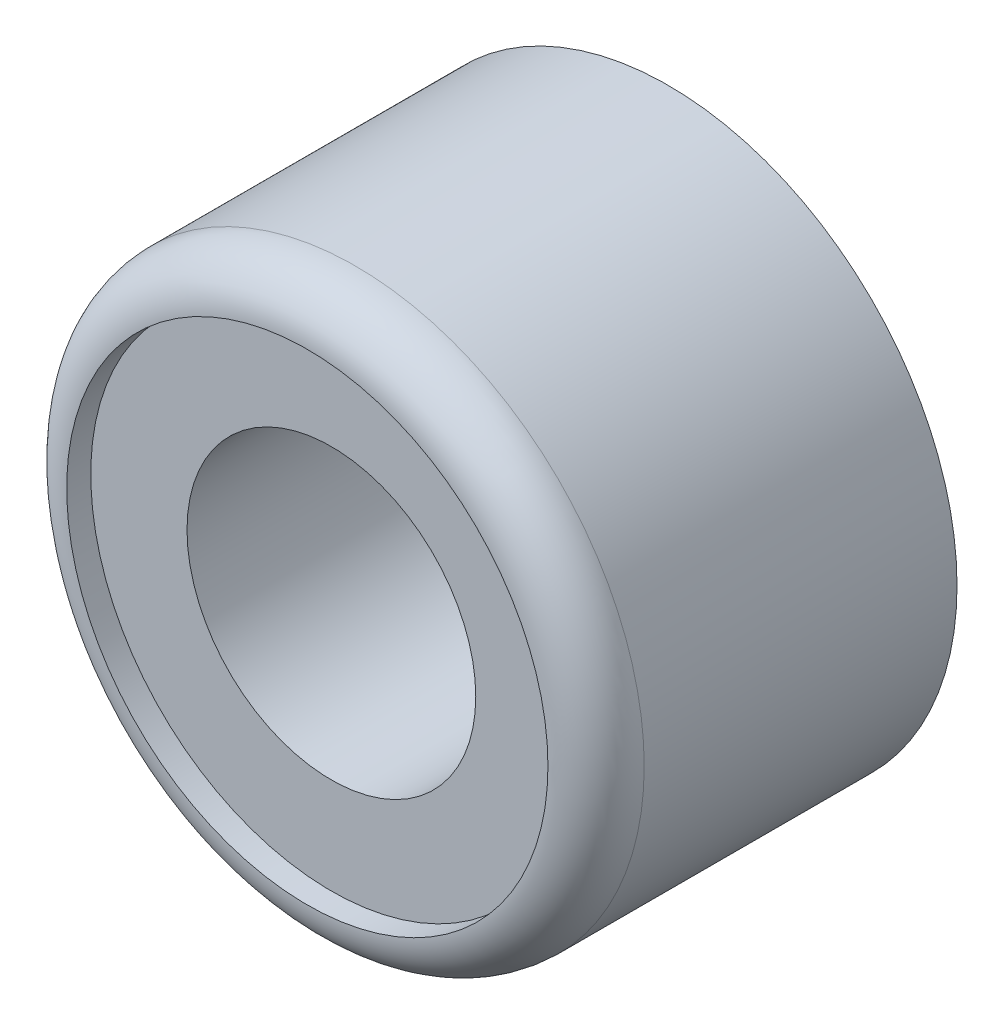
ISO-10303-21;
HEADER;
FILE_DESCRIPTION(('STEP AP214'),'2;1');
FILE_NAME('part.step','',(''),(''),'','','');
FILE_SCHEMA(('AUTOMOTIVE_DESIGN { 1 0 10303 214 1 1 1 1 }'));
ENDSEC;
DATA;
#1=APPLICATION_CONTEXT('core data for automotive mechanical design processes');
#2=APPLICATION_PROTOCOL_DEFINITION('international standard','automotive_design',2000,#1);
#3=PRODUCT_CONTEXT('',#1,'mechanical');
#4=PRODUCT('Part','Part','',(#3));
#5=PRODUCT_RELATED_PRODUCT_CATEGORY('part','',(#4));
#6=PRODUCT_DEFINITION_FORMATION('','',#4);
#7=PRODUCT_DEFINITION_CONTEXT('part definition',#1,'design');
#8=PRODUCT_DEFINITION('design','',#6,#7);
#9=PRODUCT_DEFINITION_SHAPE('','',#8);
#10=(LENGTH_UNIT() NAMED_UNIT(*) SI_UNIT(.MILLI.,.METRE.));
#11=(NAMED_UNIT(*) PLANE_ANGLE_UNIT() SI_UNIT($,.RADIAN.));
#12=(NAMED_UNIT(*) SI_UNIT($,.STERADIAN.) SOLID_ANGLE_UNIT());
#13=UNCERTAINTY_MEASURE_WITH_UNIT(LENGTH_MEASURE(1.E-05),#10,'distance_accuracy_value','');
#14=(GEOMETRIC_REPRESENTATION_CONTEXT(3) GLOBAL_UNCERTAINTY_ASSIGNED_CONTEXT((#13)) GLOBAL_UNIT_ASSIGNED_CONTEXT((#10,
#11,#12)) REPRESENTATION_CONTEXT('',''));
#15=CARTESIAN_POINT('',(0.,0.,0.));
#16=DIRECTION('',(0.,0.,1.));
#17=DIRECTION('',(1.,0.,0.));
#18=AXIS2_PLACEMENT_3D('',#15,#16,#17);
#19=CARTESIAN_POINT('',(0.,0.,1.5));
#20=DIRECTION('',(0.,0.,-1.));
#21=DIRECTION('',(-1.,0.,0.));
#22=AXIS2_PLACEMENT_3D('',#19,#20,#21);
#23=CYLINDRICAL_SURFACE('',#22,1.55);
#24=CARTESIAN_POINT('',(0.,0.,1.5));
#25=DIRECTION('',(0.,0.,1.));
#26=DIRECTION('',(1.,0.,0.));
#27=AXIS2_PLACEMENT_3D('',#24,#25,#26);
#28=CIRCLE('',#27,1.55);
#29=CARTESIAN_POINT('',(1.55,0.,1.5));
#30=VERTEX_POINT('',#29);
#31=EDGE_CURVE('E65',#30,#30,#28,.T.);
#32=ORIENTED_EDGE('',*,*,#31,.T.);
#33=EDGE_LOOP('',(#32));
#34=FACE_BOUND('',#33,.T.);
#35=CARTESIAN_POINT('',(0.,0.,0.));
#36=DIRECTION('',(0.,0.,1.));
#37=DIRECTION('',(1.,0.,0.));
#38=AXIS2_PLACEMENT_3D('',#35,#36,#37);
#39=CIRCLE('',#38,1.55);
#40=CARTESIAN_POINT('',(1.55,0.,0.));
#41=VERTEX_POINT('',#40);
#42=EDGE_CURVE('E70',#41,#41,#39,.T.);
#43=ORIENTED_EDGE('',*,*,#42,.F.);
#44=EDGE_LOOP('',(#43));
#45=FACE_BOUND('',#44,.T.);
#46=ADVANCED_FACE('F57',(#34,#45),#23,.F.);
#47=CARTESIAN_POINT('',(0.,0.,0.));
#48=DIRECTION('',(0.,0.,1.));
#49=DIRECTION('',(1.,0.,0.));
#50=AXIS2_PLACEMENT_3D('',#47,#48,#49);
#51=PLANE('',#50);
#52=ORIENTED_EDGE('',*,*,#42,.T.);
#53=EDGE_LOOP('',(#52));
#54=FACE_BOUND('',#53,.T.);
#55=CARTESIAN_POINT('',(0.,0.,0.));
#56=DIRECTION('',(0.,0.,1.));
#57=DIRECTION('',(1.,0.,0.));
#58=AXIS2_PLACEMENT_3D('',#55,#56,#57);
#59=CIRCLE('',#58,6.);
#60=CARTESIAN_POINT('',(6.,0.,0.));
#61=VERTEX_POINT('',#60);
#62=EDGE_CURVE('E90',#61,#61,#59,.T.);
#63=ORIENTED_EDGE('',*,*,#62,.F.);
#64=EDGE_LOOP('',(#63));
#65=FACE_BOUND('',#64,.T.);
#66=ADVANCED_FACE('F107',(#54,#65),#51,.F.);
#67=CARTESIAN_POINT('',(0.,0.,1.5));
#68=DIRECTION('',(0.,0.,1.));
#69=DIRECTION('',(1.,0.,0.));
#70=AXIS2_PLACEMENT_3D('',#67,#68,#69);
#71=PLANE('',#70);
#72=ORIENTED_EDGE('',*,*,#31,.F.);
#73=EDGE_LOOP('',(#72));
#74=FACE_BOUND('',#73,.T.);
#75=CARTESIAN_POINT('',(0.,0.,1.5));
#76=DIRECTION('',(0.,0.,1.));
#77=DIRECTION('',(1.,0.,0.));
#78=AXIS2_PLACEMENT_3D('',#75,#76,#77);
#79=CIRCLE('',#78,3.);
#80=CARTESIAN_POINT('',(3.,0.,1.5));
#81=VERTEX_POINT('',#80);
#82=EDGE_CURVE('E76',#81,#81,#79,.F.);
#83=ORIENTED_EDGE('',*,*,#82,.F.);
#84=EDGE_LOOP('',(#83));
#85=FACE_BOUND('',#84,.T.);
#86=ADVANCED_FACE('F109',(#74,#85),#71,.T.);
#87=CARTESIAN_POINT('',(0.,0.,7.));
#88=DIRECTION('',(0.,0.,-1.));
#89=DIRECTION('',(-1.,0.,0.));
#90=AXIS2_PLACEMENT_3D('',#87,#88,#89);
#91=CYLINDRICAL_SURFACE('',#90,3.);
#92=ORIENTED_EDGE('',*,*,#82,.T.);
#93=EDGE_LOOP('',(#92));
#94=FACE_BOUND('',#93,.T.);
#95=CARTESIAN_POINT('',(0.,0.,7.));
#96=DIRECTION('',(0.,0.,1.));
#97=DIRECTION('',(1.,0.,0.));
#98=AXIS2_PLACEMENT_3D('',#95,#96,#97);
#99=CIRCLE('',#98,3.);
#100=CARTESIAN_POINT('',(3.,0.,7.));
#101=VERTEX_POINT('',#100);
#102=EDGE_CURVE('E81',#101,#101,#99,.T.);
#103=ORIENTED_EDGE('',*,*,#102,.T.);
#104=EDGE_LOOP('',(#103));
#105=FACE_BOUND('',#104,.T.);
#106=ADVANCED_FACE('F116',(#94,#105),#91,.F.);
#107=CARTESIAN_POINT('',(0.,0.,7.));
#108=DIRECTION('',(0.,0.,1.));
#109=DIRECTION('',(1.,0.,0.));
#110=AXIS2_PLACEMENT_3D('',#107,#108,#109);
#111=PLANE('',#110);
#112=ORIENTED_EDGE('',*,*,#102,.F.);
#113=EDGE_LOOP('',(#112));
#114=FACE_BOUND('',#113,.T.);
#115=CARTESIAN_POINT('',(0.,0.,7.));
#116=DIRECTION('',(0.,0.,1.));
#117=DIRECTION('',(1.,0.,0.));
#118=AXIS2_PLACEMENT_3D('',#115,#116,#117);
#119=CIRCLE('',#118,5.);
#120=CARTESIAN_POINT('',(5.,0.,7.));
#121=VERTEX_POINT('',#120);
#122=EDGE_CURVE('E85',#121,#121,#119,.F.);
#123=ORIENTED_EDGE('',*,*,#122,.F.);
#124=EDGE_LOOP('',(#123));
#125=FACE_BOUND('',#124,.T.);
#126=ADVANCED_FACE('F123',(#114,#125),#111,.T.);
#127=CARTESIAN_POINT('',(0.,0.,7.5));
#128=DIRECTION('',(0.,0.,-1.));
#129=DIRECTION('',(-1.,0.,0.));
#130=AXIS2_PLACEMENT_3D('',#127,#128,#129);
#131=CYLINDRICAL_SURFACE('',#130,5.);
#132=ORIENTED_EDGE('',*,*,#122,.T.);
#133=EDGE_LOOP('',(#132));
#134=FACE_BOUND('',#133,.T.);
#135=CARTESIAN_POINT('',(0.,0.,7.5));
#136=DIRECTION('',(0.,0.,1.));
#137=DIRECTION('',(1.,0.,0.));
#138=AXIS2_PLACEMENT_3D('',#135,#136,#137);
#139=CIRCLE('',#138,5.);
#140=CARTESIAN_POINT('',(5.,0.,7.5));
#141=VERTEX_POINT('',#140);
#142=EDGE_CURVE('E89',#141,#141,#139,.T.);
#143=ORIENTED_EDGE('',*,*,#142,.T.);
#144=EDGE_LOOP('',(#143));
#145=FACE_BOUND('',#144,.T.);
#146=ADVANCED_FACE('F98',(#134,#145),#131,.F.);
#147=CARTESIAN_POINT('',(0.,0.,7.5));
#148=DIRECTION('',(0.,0.,-1.));
#149=DIRECTION('',(-1.,0.,0.));
#150=AXIS2_PLACEMENT_3D('',#147,#148,#149);
#151=CYLINDRICAL_SURFACE('',#150,6.);
#152=CARTESIAN_POINT('',(0.,0.,6.5));
#153=DIRECTION('',(0.,0.,1.));
#154=DIRECTION('',(1.,0.,0.));
#155=AXIS2_PLACEMENT_3D('',#152,#153,#154);
#156=CIRCLE('',#155,6.);
#157=CARTESIAN_POINT('',(6.,0.,6.5));
#158=VERTEX_POINT('',#157);
#159=EDGE_CURVE('E11',#158,#158,#156,.F.);
#160=ORIENTED_EDGE('',*,*,#159,.T.);
#161=EDGE_LOOP('',(#160));
#162=FACE_BOUND('',#161,.T.);
#163=ORIENTED_EDGE('',*,*,#62,.T.);
#164=EDGE_LOOP('',(#163));
#165=FACE_BOUND('',#164,.T.);
#166=ADVANCED_FACE('F101',(#162,#165),#151,.T.);
#167=CARTESIAN_POINT('',(0.,0.,6.5));
#168=DIRECTION('',(0.,0.,1.));
#169=DIRECTION('',(1.,0.,0.));
#170=AXIS2_PLACEMENT_3D('',#167,#168,#169);
#171=TOROIDAL_SURFACE('',#170,5.,1.);
#172=ORIENTED_EDGE('',*,*,#159,.F.);
#173=EDGE_LOOP('',(#172));
#174=FACE_BOUND('',#173,.T.);
#175=ORIENTED_EDGE('',*,*,#142,.F.);
#176=EDGE_LOOP('',(#175));
#177=FACE_BOUND('',#176,.T.);
#178=ADVANCED_FACE('F59',(#174,#177),#171,.T.);
#179=CLOSED_SHELL('',(#46,#66,#86,#106,#126,#146,#166,#178));
#180=MANIFOLD_SOLID_BREP('B2',#179);
#181=ADVANCED_BREP_SHAPE_REPRESENTATION('',(#18,#180),#14);
#182=SHAPE_DEFINITION_REPRESENTATION(#9,#181);
ENDSEC;
END-ISO-10303-21;
